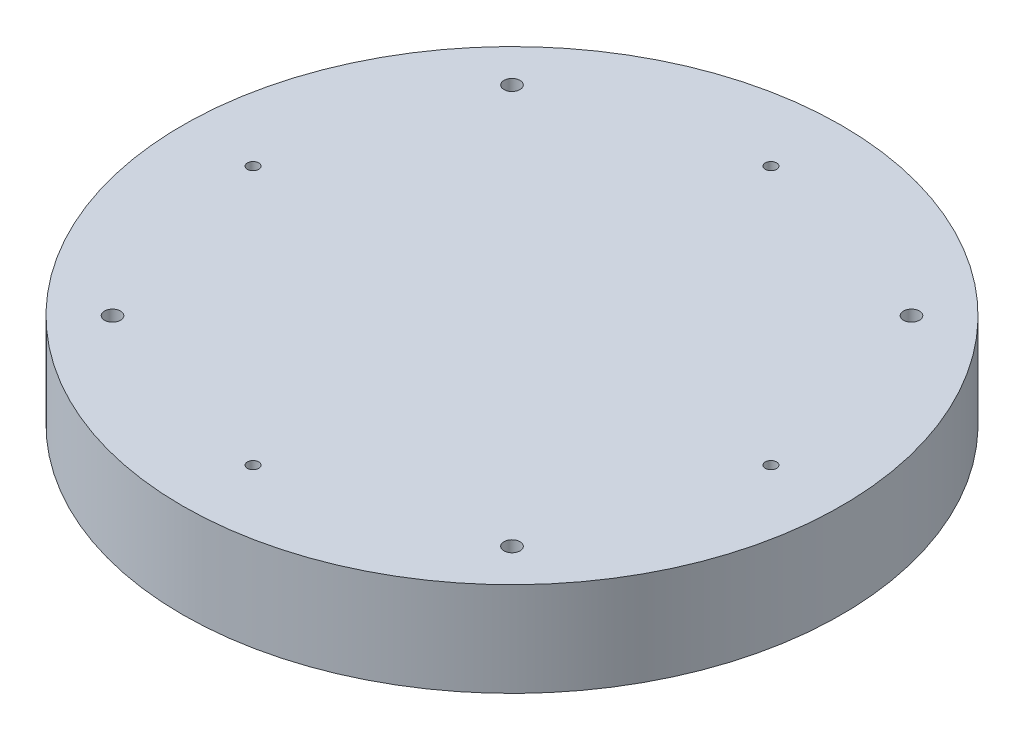
ISO-10303-21;
HEADER;
FILE_DESCRIPTION(('STEP AP214'),'2;1');
FILE_NAME('part.step','',(''),(''),'','','');
FILE_SCHEMA(('AUTOMOTIVE_DESIGN { 1 0 10303 214 1 1 1 1 }'));
ENDSEC;
DATA;
#1=APPLICATION_CONTEXT('core data for automotive mechanical design processes');
#2=APPLICATION_PROTOCOL_DEFINITION('international standard','automotive_design',2000,#1);
#3=PRODUCT_CONTEXT('',#1,'mechanical');
#4=PRODUCT('Part','Part','',(#3));
#5=PRODUCT_RELATED_PRODUCT_CATEGORY('part','',(#4));
#6=PRODUCT_DEFINITION_FORMATION('','',#4);
#7=PRODUCT_DEFINITION_CONTEXT('part definition',#1,'design');
#8=PRODUCT_DEFINITION('design','',#6,#7);
#9=PRODUCT_DEFINITION_SHAPE('','',#8);
#10=(LENGTH_UNIT() NAMED_UNIT(*) SI_UNIT(.MILLI.,.METRE.));
#11=(NAMED_UNIT(*) PLANE_ANGLE_UNIT() SI_UNIT($,.RADIAN.));
#12=(NAMED_UNIT(*) SI_UNIT($,.STERADIAN.) SOLID_ANGLE_UNIT());
#13=UNCERTAINTY_MEASURE_WITH_UNIT(LENGTH_MEASURE(1.E-05),#10,'distance_accuracy_value','');
#14=(GEOMETRIC_REPRESENTATION_CONTEXT(3) GLOBAL_UNCERTAINTY_ASSIGNED_CONTEXT((#13)) GLOBAL_UNIT_ASSIGNED_CONTEXT((#10,
#11,#12)) REPRESENTATION_CONTEXT('',''));
#15=CARTESIAN_POINT('',(0.,0.,0.));
#16=DIRECTION('',(0.,0.,1.));
#17=DIRECTION('',(1.,0.,0.));
#18=AXIS2_PLACEMENT_3D('',#15,#16,#17);
#19=CARTESIAN_POINT('',(0.,-20.,0.));
#20=DIRECTION('',(0.,-1.,0.));
#21=DIRECTION('',(0.,0.,-1.));
#22=AXIS2_PLACEMENT_3D('',#19,#20,#21);
#23=PLANE('',#22);
#24=CARTESIAN_POINT('',(-78.3673380921717,-20.,-0.00172774714470213));
#25=DIRECTION('',(0.,-1.,0.));
#26=DIRECTION('',(0.,0.,-1.));
#27=AXIS2_PLACEMENT_3D('',#24,#25,#26);
#28=CIRCLE('',#27,2.99999999999999);
#29=CARTESIAN_POINT('',(-78.3673380921717,-20.,-3.00172774714469));
#30=VERTEX_POINT('',#29);
#31=EDGE_CURVE('E78',#30,#30,#28,.T.);
#32=ORIENTED_EDGE('',*,*,#31,.F.);
#33=EDGE_LOOP('',(#32));
#34=FACE_BOUND('',#33,.T.);
#35=CARTESIAN_POINT('',(0.0678619078261153,-20.,78.4842722528575));
#36=DIRECTION('',(0.,-1.,0.));
#37=DIRECTION('',(0.,0.,-1.));
#38=AXIS2_PLACEMENT_3D('',#35,#36,#37);
#39=CIRCLE('',#38,2.99999999999999);
#40=CARTESIAN_POINT('',(0.0678619078261153,-20.,75.4842722528576));
#41=VERTEX_POINT('',#40);
#42=EDGE_CURVE('E77',#41,#41,#39,.T.);
#43=ORIENTED_EDGE('',*,*,#42,.F.);
#44=EDGE_LOOP('',(#43));
#45=FACE_BOUND('',#44,.T.);
#46=CARTESIAN_POINT('',(78.5030619078283,-20.,-0.00172774714025321));
#47=DIRECTION('',(0.,-1.,0.));
#48=DIRECTION('',(0.,0.,-1.));
#49=AXIS2_PLACEMENT_3D('',#46,#47,#48);
#50=CIRCLE('',#49,2.99999999999999);
#51=CARTESIAN_POINT('',(78.5030619078283,-20.,-3.00172774714024));
#52=VERTEX_POINT('',#51);
#53=EDGE_CURVE('E88',#52,#52,#50,.T.);
#54=ORIENTED_EDGE('',*,*,#53,.F.);
#55=EDGE_LOOP('',(#54));
#56=FACE_BOUND('',#55,.T.);
#57=CARTESIAN_POINT('',(0.0678619078261153,-20.,-78.4877277471425));
#58=DIRECTION('',(0.,-1.,0.));
#59=DIRECTION('',(0.,0.,-1.));
#60=AXIS2_PLACEMENT_3D('',#57,#58,#59);
#61=CIRCLE('',#60,2.99999999999999);
#62=CARTESIAN_POINT('',(0.0678619078261153,-20.,-81.4877277471425));
#63=VERTEX_POINT('',#62);
#64=EDGE_CURVE('E94',#63,#63,#61,.T.);
#65=ORIENTED_EDGE('',*,*,#64,.F.);
#66=EDGE_LOOP('',(#65));
#67=FACE_BOUND('',#66,.T.);
#68=CARTESIAN_POINT('',(-137.5,-20.,0.));
#69=DIRECTION('',(0.,1.,0.));
#70=DIRECTION('',(0.,0.,1.));
#71=AXIS2_PLACEMENT_3D('',#68,#69,#70);
#72=CIRCLE('',#71,2.99999999999998);
#73=CARTESIAN_POINT('',(-137.5,-20.,2.99999999999998));
#74=VERTEX_POINT('',#73);
#75=EDGE_CURVE('E103',#74,#74,#72,.T.);
#76=ORIENTED_EDGE('',*,*,#75,.T.);
#77=EDGE_LOOP('',(#76));
#78=FACE_BOUND('',#77,.T.);
#79=CARTESIAN_POINT('',(0.,-20.,137.5));
#80=DIRECTION('',(0.,1.,0.));
#81=DIRECTION('',(0.,0.,1.));
#82=AXIS2_PLACEMENT_3D('',#79,#80,#81);
#83=CIRCLE('',#82,2.99999999999999);
#84=CARTESIAN_POINT('',(0.,-20.,140.5));
#85=VERTEX_POINT('',#84);
#86=EDGE_CURVE('E109',#85,#85,#83,.T.);
#87=ORIENTED_EDGE('',*,*,#86,.T.);
#88=EDGE_LOOP('',(#87));
#89=FACE_BOUND('',#88,.T.);
#90=CARTESIAN_POINT('',(137.5,-20.,0.));
#91=DIRECTION('',(0.,1.,0.));
#92=DIRECTION('',(0.,0.,1.));
#93=AXIS2_PLACEMENT_3D('',#90,#91,#92);
#94=CIRCLE('',#93,2.99999999999998);
#95=CARTESIAN_POINT('',(137.5,-20.,2.99999999999998));
#96=VERTEX_POINT('',#95);
#97=EDGE_CURVE('E115',#96,#96,#94,.T.);
#98=ORIENTED_EDGE('',*,*,#97,.T.);
#99=EDGE_LOOP('',(#98));
#100=FACE_BOUND('',#99,.T.);
#101=CARTESIAN_POINT('',(0.,-20.,0.));
#102=DIRECTION('',(0.,-1.,0.));
#103=DIRECTION('',(0.,0.,-1.));
#104=AXIS2_PLACEMENT_3D('',#101,#102,#103);
#105=CIRCLE('',#104,175.);
#106=CARTESIAN_POINT('',(0.,-20.,-175.));
#107=VERTEX_POINT('',#106);
#108=EDGE_CURVE('E124',#107,#107,#105,.T.);
#109=ORIENTED_EDGE('',*,*,#108,.T.);
#110=EDGE_LOOP('',(#109));
#111=FACE_BOUND('',#110,.T.);
#112=CARTESIAN_POINT('',(0.,-20.,-137.5));
#113=DIRECTION('',(0.,1.,0.));
#114=DIRECTION('',(0.,0.,1.));
#115=AXIS2_PLACEMENT_3D('',#112,#113,#114);
#116=CIRCLE('',#115,2.99999999999999);
#117=CARTESIAN_POINT('',(0.,-20.,-134.5));
#118=VERTEX_POINT('',#117);
#119=EDGE_CURVE('E121',#118,#118,#116,.T.);
#120=ORIENTED_EDGE('',*,*,#119,.T.);
#121=EDGE_LOOP('',(#120));
#122=FACE_BOUND('',#121,.T.);
#123=ADVANCED_FACE('F34',(#34,#45,#56,#67,#78,#89,#100,#111,#122),#23,.T.);
#124=CARTESIAN_POINT('',(0.,30.,0.));
#125=DIRECTION('',(0.,-1.,0.));
#126=DIRECTION('',(0.,0.,-1.));
#127=AXIS2_PLACEMENT_3D('',#124,#125,#126);
#128=CYLINDRICAL_SURFACE('',#127,175.);
#129=CARTESIAN_POINT('',(0.,30.,0.));
#130=DIRECTION('',(0.,1.,0.));
#131=DIRECTION('',(0.,0.,1.));
#132=AXIS2_PLACEMENT_3D('',#129,#130,#131);
#133=CIRCLE('',#132,175.);
#134=CARTESIAN_POINT('',(0.,30.,175.));
#135=VERTEX_POINT('',#134);
#136=EDGE_CURVE('E11',#135,#135,#133,.T.);
#137=ORIENTED_EDGE('',*,*,#136,.F.);
#138=EDGE_LOOP('',(#137));
#139=FACE_BOUND('',#138,.T.);
#140=ORIENTED_EDGE('',*,*,#108,.F.);
#141=EDGE_LOOP('',(#140));
#142=FACE_BOUND('',#141,.T.);
#143=ADVANCED_FACE('F36',(#139,#142),#128,.T.);
#144=CARTESIAN_POINT('',(0.,30.,0.));
#145=DIRECTION('',(0.,1.,0.));
#146=DIRECTION('',(0.,0.,1.));
#147=AXIS2_PLACEMENT_3D('',#144,#145,#146);
#148=PLANE('',#147);
#149=CARTESIAN_POINT('',(-137.5,30.,0.));
#150=DIRECTION('',(0.,1.,0.));
#151=DIRECTION('',(0.,0.,1.));
#152=AXIS2_PLACEMENT_3D('',#149,#150,#151);
#153=CIRCLE('',#152,3.);
#154=CARTESIAN_POINT('',(-137.5,30.,3.));
#155=VERTEX_POINT('',#154);
#156=EDGE_CURVE('E100',#155,#155,#153,.T.);
#157=ORIENTED_EDGE('',*,*,#156,.F.);
#158=EDGE_LOOP('',(#157));
#159=FACE_BOUND('',#158,.T.);
#160=CARTESIAN_POINT('',(0.,30.,137.5));
#161=DIRECTION('',(0.,1.,0.));
#162=DIRECTION('',(0.,0.,1.));
#163=AXIS2_PLACEMENT_3D('',#160,#161,#162);
#164=CIRCLE('',#163,2.99999999999999);
#165=CARTESIAN_POINT('',(0.,30.,140.5));
#166=VERTEX_POINT('',#165);
#167=EDGE_CURVE('E106',#166,#166,#164,.T.);
#168=ORIENTED_EDGE('',*,*,#167,.F.);
#169=EDGE_LOOP('',(#168));
#170=FACE_BOUND('',#169,.T.);
#171=CARTESIAN_POINT('',(137.5,30.,0.));
#172=DIRECTION('',(0.,1.,0.));
#173=DIRECTION('',(0.,0.,1.));
#174=AXIS2_PLACEMENT_3D('',#171,#172,#173);
#175=CIRCLE('',#174,3.);
#176=CARTESIAN_POINT('',(137.5,30.,3.));
#177=VERTEX_POINT('',#176);
#178=EDGE_CURVE('E112',#177,#177,#175,.T.);
#179=ORIENTED_EDGE('',*,*,#178,.F.);
#180=EDGE_LOOP('',(#179));
#181=FACE_BOUND('',#180,.T.);
#182=CARTESIAN_POINT('',(0.,30.,-137.5));
#183=DIRECTION('',(0.,1.,0.));
#184=DIRECTION('',(0.,0.,1.));
#185=AXIS2_PLACEMENT_3D('',#182,#183,#184);
#186=CIRCLE('',#185,2.99999999999999);
#187=CARTESIAN_POINT('',(0.,30.,-134.5));
#188=VERTEX_POINT('',#187);
#189=EDGE_CURVE('E118',#188,#188,#186,.T.);
#190=ORIENTED_EDGE('',*,*,#189,.F.);
#191=EDGE_LOOP('',(#190));
#192=FACE_BOUND('',#191,.T.);
#193=CARTESIAN_POINT('',(-106.066017177982,30.,106.066017177982));
#194=DIRECTION('',(0.,1.,0.));
#195=DIRECTION('',(0.,0.,1.));
#196=AXIS2_PLACEMENT_3D('',#193,#194,#195);
#197=CIRCLE('',#196,4.25);
#198=CARTESIAN_POINT('',(-106.066017177982,30.,110.316017177982));
#199=VERTEX_POINT('',#198);
#200=EDGE_CURVE('E127',#199,#199,#197,.T.);
#201=ORIENTED_EDGE('',*,*,#200,.F.);
#202=EDGE_LOOP('',(#201));
#203=FACE_BOUND('',#202,.T.);
#204=CARTESIAN_POINT('',(106.066017177982,30.,106.066017177982));
#205=DIRECTION('',(0.,1.,0.));
#206=DIRECTION('',(0.,0.,1.));
#207=AXIS2_PLACEMENT_3D('',#204,#205,#206);
#208=CIRCLE('',#207,4.25);
#209=CARTESIAN_POINT('',(106.066017177982,30.,110.316017177982));
#210=VERTEX_POINT('',#209);
#211=EDGE_CURVE('E133',#210,#210,#208,.T.);
#212=ORIENTED_EDGE('',*,*,#211,.F.);
#213=EDGE_LOOP('',(#212));
#214=FACE_BOUND('',#213,.T.);
#215=CARTESIAN_POINT('',(106.066017177982,30.,-106.066017177982));
#216=DIRECTION('',(0.,1.,0.));
#217=DIRECTION('',(0.,0.,1.));
#218=AXIS2_PLACEMENT_3D('',#215,#216,#217);
#219=CIRCLE('',#218,4.25);
#220=CARTESIAN_POINT('',(106.066017177982,30.,-101.816017177982));
#221=VERTEX_POINT('',#220);
#222=EDGE_CURVE('E139',#221,#221,#219,.T.);
#223=ORIENTED_EDGE('',*,*,#222,.F.);
#224=EDGE_LOOP('',(#223));
#225=FACE_BOUND('',#224,.T.);
#226=CARTESIAN_POINT('',(-106.066017177982,30.,-106.066017177982));
#227=DIRECTION('',(0.,1.,0.));
#228=DIRECTION('',(0.,0.,1.));
#229=AXIS2_PLACEMENT_3D('',#226,#227,#228);
#230=CIRCLE('',#229,4.25);
#231=CARTESIAN_POINT('',(-106.066017177982,30.,-101.816017177982));
#232=VERTEX_POINT('',#231);
#233=EDGE_CURVE('E145',#232,#232,#230,.T.);
#234=ORIENTED_EDGE('',*,*,#233,.F.);
#235=EDGE_LOOP('',(#234));
#236=FACE_BOUND('',#235,.T.);
#237=ORIENTED_EDGE('',*,*,#136,.T.);
#238=EDGE_LOOP('',(#237));
#239=FACE_BOUND('',#238,.T.);
#240=ADVANCED_FACE('F159',(#159,#170,#181,#192,#203,#214,#225,#236,#239),#148,.T.);
#241=CARTESIAN_POINT('',(-106.066017177982,10.,-106.066017177982));
#242=DIRECTION('',(0.,1.,0.));
#243=DIRECTION('',(0.,0.,1.));
#244=AXIS2_PLACEMENT_3D('',#241,#242,#243);
#245=CONICAL_SURFACE('',#244,4.24999999999999,1.02974425867665);
#246=CARTESIAN_POINT('',(-106.066017177982,7.44634236913287,-106.066017177982));
#247=VERTEX_POINT('',#246);
#248=VERTEX_LOOP('',#247);
#249=FACE_BOUND('',#248,.T.);
#250=CARTESIAN_POINT('',(-106.066017177982,10.,-106.066017177982));
#251=DIRECTION('',(0.,1.,0.));
#252=DIRECTION('',(0.,0.,1.));
#253=AXIS2_PLACEMENT_3D('',#250,#251,#252);
#254=CIRCLE('',#253,4.24999999999999);
#255=CARTESIAN_POINT('',(-106.066017177982,10.,-101.816017177982));
#256=VERTEX_POINT('',#255);
#257=EDGE_CURVE('E42',#256,#256,#254,.T.);
#258=ORIENTED_EDGE('',*,*,#257,.T.);
#259=EDGE_LOOP('',(#258));
#260=FACE_BOUND('',#259,.T.);
#261=ADVANCED_FACE('F150',(#249,#260),#245,.F.);
#262=CARTESIAN_POINT('',(-106.066017177982,30.,-106.066017177982));
#263=DIRECTION('',(0.,1.,0.));
#264=DIRECTION('',(0.,0.,1.));
#265=AXIS2_PLACEMENT_3D('',#262,#263,#264);
#266=CYLINDRICAL_SURFACE('',#265,4.25);
#267=ORIENTED_EDGE('',*,*,#257,.F.);
#268=EDGE_LOOP('',(#267));
#269=FACE_BOUND('',#268,.T.);
#270=ORIENTED_EDGE('',*,*,#233,.T.);
#271=EDGE_LOOP('',(#270));
#272=FACE_BOUND('',#271,.T.);
#273=ADVANCED_FACE('F152',(#269,#272),#266,.F.);
#274=CARTESIAN_POINT('',(106.066017177982,10.,-106.066017177982));
#275=DIRECTION('',(0.,1.,0.));
#276=DIRECTION('',(0.,0.,1.));
#277=AXIS2_PLACEMENT_3D('',#274,#275,#276);
#278=CONICAL_SURFACE('',#277,4.25,1.02974425867665);
#279=CARTESIAN_POINT('',(106.066017177982,7.44634236913287,-106.066017177982));
#280=VERTEX_POINT('',#279);
#281=VERTEX_LOOP('',#280);
#282=FACE_BOUND('',#281,.T.);
#283=CARTESIAN_POINT('',(106.066017177982,10.,-106.066017177982));
#284=DIRECTION('',(0.,1.,0.));
#285=DIRECTION('',(0.,0.,1.));
#286=AXIS2_PLACEMENT_3D('',#283,#284,#285);
#287=CIRCLE('',#286,4.25);
#288=CARTESIAN_POINT('',(106.066017177982,10.,-101.816017177982));
#289=VERTEX_POINT('',#288);
#290=EDGE_CURVE('E142',#289,#289,#287,.T.);
#291=ORIENTED_EDGE('',*,*,#290,.T.);
#292=EDGE_LOOP('',(#291));
#293=FACE_BOUND('',#292,.T.);
#294=ADVANCED_FACE('F155',(#282,#293),#278,.F.);
#295=CARTESIAN_POINT('',(106.066017177982,30.,-106.066017177982));
#296=DIRECTION('',(0.,1.,0.));
#297=DIRECTION('',(0.,0.,1.));
#298=AXIS2_PLACEMENT_3D('',#295,#296,#297);
#299=CYLINDRICAL_SURFACE('',#298,4.25);
#300=ORIENTED_EDGE('',*,*,#290,.F.);
#301=EDGE_LOOP('',(#300));
#302=FACE_BOUND('',#301,.T.);
#303=ORIENTED_EDGE('',*,*,#222,.T.);
#304=EDGE_LOOP('',(#303));
#305=FACE_BOUND('',#304,.T.);
#306=ADVANCED_FACE('F190',(#302,#305),#299,.F.);
#307=CARTESIAN_POINT('',(106.066017177982,10.,106.066017177982));
#308=DIRECTION('',(0.,1.,0.));
#309=DIRECTION('',(0.,0.,1.));
#310=AXIS2_PLACEMENT_3D('',#307,#308,#309);
#311=CONICAL_SURFACE('',#310,4.25,1.02974425867665);
#312=CARTESIAN_POINT('',(106.066017177982,7.44634236913287,106.066017177982));
#313=VERTEX_POINT('',#312);
#314=VERTEX_LOOP('',#313);
#315=FACE_BOUND('',#314,.T.);
#316=CARTESIAN_POINT('',(106.066017177982,10.,106.066017177982));
#317=DIRECTION('',(0.,1.,0.));
#318=DIRECTION('',(0.,0.,1.));
#319=AXIS2_PLACEMENT_3D('',#316,#317,#318);
#320=CIRCLE('',#319,4.25);
#321=CARTESIAN_POINT('',(106.066017177982,10.,110.316017177982));
#322=VERTEX_POINT('',#321);
#323=EDGE_CURVE('E136',#322,#322,#320,.T.);
#324=ORIENTED_EDGE('',*,*,#323,.T.);
#325=EDGE_LOOP('',(#324));
#326=FACE_BOUND('',#325,.T.);
#327=ADVANCED_FACE('F192',(#315,#326),#311,.F.);
#328=CARTESIAN_POINT('',(106.066017177982,30.,106.066017177982));
#329=DIRECTION('',(0.,1.,0.));
#330=DIRECTION('',(0.,0.,1.));
#331=AXIS2_PLACEMENT_3D('',#328,#329,#330);
#332=CYLINDRICAL_SURFACE('',#331,4.25);
#333=ORIENTED_EDGE('',*,*,#323,.F.);
#334=EDGE_LOOP('',(#333));
#335=FACE_BOUND('',#334,.T.);
#336=ORIENTED_EDGE('',*,*,#211,.T.);
#337=EDGE_LOOP('',(#336));
#338=FACE_BOUND('',#337,.T.);
#339=ADVANCED_FACE('F199',(#335,#338),#332,.F.);
#340=CARTESIAN_POINT('',(-106.066017177982,10.,106.066017177982));
#341=DIRECTION('',(0.,1.,0.));
#342=DIRECTION('',(0.,0.,1.));
#343=AXIS2_PLACEMENT_3D('',#340,#341,#342);
#344=CONICAL_SURFACE('',#343,4.24999999999999,1.02974425867665);
#345=CARTESIAN_POINT('',(-106.066017177982,7.44634236913287,106.066017177982));
#346=VERTEX_POINT('',#345);
#347=VERTEX_LOOP('',#346);
#348=FACE_BOUND('',#347,.T.);
#349=CARTESIAN_POINT('',(-106.066017177982,10.,106.066017177982));
#350=DIRECTION('',(0.,1.,0.));
#351=DIRECTION('',(0.,0.,1.));
#352=AXIS2_PLACEMENT_3D('',#349,#350,#351);
#353=CIRCLE('',#352,4.24999999999999);
#354=CARTESIAN_POINT('',(-106.066017177982,10.,110.316017177982));
#355=VERTEX_POINT('',#354);
#356=EDGE_CURVE('E130',#355,#355,#353,.T.);
#357=ORIENTED_EDGE('',*,*,#356,.T.);
#358=EDGE_LOOP('',(#357));
#359=FACE_BOUND('',#358,.T.);
#360=ADVANCED_FACE('F244',(#348,#359),#344,.F.);
#361=CARTESIAN_POINT('',(-106.066017177982,30.,106.066017177982));
#362=DIRECTION('',(0.,1.,0.));
#363=DIRECTION('',(0.,0.,1.));
#364=AXIS2_PLACEMENT_3D('',#361,#362,#363);
#365=CYLINDRICAL_SURFACE('',#364,4.25);
#366=ORIENTED_EDGE('',*,*,#356,.F.);
#367=EDGE_LOOP('',(#366));
#368=FACE_BOUND('',#367,.T.);
#369=ORIENTED_EDGE('',*,*,#200,.T.);
#370=EDGE_LOOP('',(#369));
#371=FACE_BOUND('',#370,.T.);
#372=ADVANCED_FACE('F179',(#368,#371),#365,.F.);
#373=CARTESIAN_POINT('',(0.,30.,-137.5));
#374=DIRECTION('',(0.,1.,0.));
#375=DIRECTION('',(0.,0.,1.));
#376=AXIS2_PLACEMENT_3D('',#373,#374,#375);
#377=CYLINDRICAL_SURFACE('',#376,2.99999999999999);
#378=ORIENTED_EDGE('',*,*,#119,.F.);
#379=EDGE_LOOP('',(#378));
#380=FACE_BOUND('',#379,.T.);
#381=ORIENTED_EDGE('',*,*,#189,.T.);
#382=EDGE_LOOP('',(#381));
#383=FACE_BOUND('',#382,.T.);
#384=ADVANCED_FACE('F175',(#380,#383),#377,.F.);
#385=CARTESIAN_POINT('',(137.5,30.,0.));
#386=DIRECTION('',(0.,1.,0.));
#387=DIRECTION('',(0.,0.,1.));
#388=AXIS2_PLACEMENT_3D('',#385,#386,#387);
#389=CYLINDRICAL_SURFACE('',#388,2.99999999999999);
#390=ORIENTED_EDGE('',*,*,#97,.F.);
#391=EDGE_LOOP('',(#390));
#392=FACE_BOUND('',#391,.T.);
#393=ORIENTED_EDGE('',*,*,#178,.T.);
#394=EDGE_LOOP('',(#393));
#395=FACE_BOUND('',#394,.T.);
#396=ADVANCED_FACE('F178',(#392,#395),#389,.F.);
#397=CARTESIAN_POINT('',(0.,30.,137.5));
#398=DIRECTION('',(0.,1.,0.));
#399=DIRECTION('',(0.,0.,1.));
#400=AXIS2_PLACEMENT_3D('',#397,#398,#399);
#401=CYLINDRICAL_SURFACE('',#400,2.99999999999999);
#402=ORIENTED_EDGE('',*,*,#86,.F.);
#403=EDGE_LOOP('',(#402));
#404=FACE_BOUND('',#403,.T.);
#405=ORIENTED_EDGE('',*,*,#167,.T.);
#406=EDGE_LOOP('',(#405));
#407=FACE_BOUND('',#406,.T.);
#408=ADVANCED_FACE('F289',(#404,#407),#401,.F.);
#409=CARTESIAN_POINT('',(-137.5,30.,0.));
#410=DIRECTION('',(0.,1.,0.));
#411=DIRECTION('',(0.,0.,1.));
#412=AXIS2_PLACEMENT_3D('',#409,#410,#411);
#413=CYLINDRICAL_SURFACE('',#412,2.99999999999999);
#414=ORIENTED_EDGE('',*,*,#75,.F.);
#415=EDGE_LOOP('',(#414));
#416=FACE_BOUND('',#415,.T.);
#417=ORIENTED_EDGE('',*,*,#156,.T.);
#418=EDGE_LOOP('',(#417));
#419=FACE_BOUND('',#418,.T.);
#420=ADVANCED_FACE('F299',(#416,#419),#413,.F.);
#421=CARTESIAN_POINT('',(0.0678619078261153,0.,-78.4877277471425));
#422=DIRECTION('',(0.,-1.,0.));
#423=DIRECTION('',(0.,0.,-1.));
#424=AXIS2_PLACEMENT_3D('',#421,#422,#423);
#425=CONICAL_SURFACE('',#424,2.99999999999999,1.02974425867665);
#426=CARTESIAN_POINT('',(0.0678619078261099,1.80258185708268,-78.4877277471425));
#427=VERTEX_POINT('',#426);
#428=VERTEX_LOOP('',#427);
#429=FACE_BOUND('',#428,.T.);
#430=CARTESIAN_POINT('',(0.0678619078261153,0.,-78.4877277471425));
#431=DIRECTION('',(0.,-1.,0.));
#432=DIRECTION('',(0.,0.,-1.));
#433=AXIS2_PLACEMENT_3D('',#430,#431,#432);
#434=CIRCLE('',#433,2.99999999999999);
#435=CARTESIAN_POINT('',(0.0678619078261153,0.,-81.4877277471425));
#436=VERTEX_POINT('',#435);
#437=EDGE_CURVE('E97',#436,#436,#434,.T.);
#438=ORIENTED_EDGE('',*,*,#437,.T.);
#439=EDGE_LOOP('',(#438));
#440=FACE_BOUND('',#439,.T.);
#441=ADVANCED_FACE('F309',(#429,#440),#425,.F.);
#442=CARTESIAN_POINT('',(0.0678619078261153,-20.,-78.4877277471425));
#443=DIRECTION('',(0.,-1.,0.));
#444=DIRECTION('',(0.,0.,-1.));
#445=AXIS2_PLACEMENT_3D('',#442,#443,#444);
#446=CYLINDRICAL_SURFACE('',#445,2.99999999999999);
#447=ORIENTED_EDGE('',*,*,#437,.F.);
#448=EDGE_LOOP('',(#447));
#449=FACE_BOUND('',#448,.T.);
#450=ORIENTED_EDGE('',*,*,#64,.T.);
#451=EDGE_LOOP('',(#450));
#452=FACE_BOUND('',#451,.T.);
#453=ADVANCED_FACE('F324',(#449,#452),#446,.F.);
#454=CARTESIAN_POINT('',(78.5030619078283,0.,-0.00172774714025321));
#455=DIRECTION('',(0.,-1.,0.));
#456=DIRECTION('',(0.,0.,-1.));
#457=AXIS2_PLACEMENT_3D('',#454,#455,#456);
#458=CONICAL_SURFACE('',#457,2.99999999999999,1.02974425867665);
#459=CARTESIAN_POINT('',(78.5030619078283,1.80258185708268,-0.00172774714025321));
#460=VERTEX_POINT('',#459);
#461=VERTEX_LOOP('',#460);
#462=FACE_BOUND('',#461,.T.);
#463=CARTESIAN_POINT('',(78.5030619078283,0.,-0.00172774714025321));
#464=DIRECTION('',(0.,-1.,0.));
#465=DIRECTION('',(0.,0.,-1.));
#466=AXIS2_PLACEMENT_3D('',#463,#464,#465);
#467=CIRCLE('',#466,2.99999999999999);
#468=CARTESIAN_POINT('',(78.5030619078283,0.,-3.00172774714024));
#469=VERTEX_POINT('',#468);
#470=EDGE_CURVE('E91',#469,#469,#467,.T.);
#471=ORIENTED_EDGE('',*,*,#470,.T.);
#472=EDGE_LOOP('',(#471));
#473=FACE_BOUND('',#472,.T.);
#474=ADVANCED_FACE('F334',(#462,#473),#458,.F.);
#475=CARTESIAN_POINT('',(78.5030619078283,-20.,-0.00172774714025321));
#476=DIRECTION('',(0.,-1.,0.));
#477=DIRECTION('',(0.,0.,-1.));
#478=AXIS2_PLACEMENT_3D('',#475,#476,#477);
#479=CYLINDRICAL_SURFACE('',#478,2.99999999999999);
#480=ORIENTED_EDGE('',*,*,#470,.F.);
#481=EDGE_LOOP('',(#480));
#482=FACE_BOUND('',#481,.T.);
#483=ORIENTED_EDGE('',*,*,#53,.T.);
#484=EDGE_LOOP('',(#483));
#485=FACE_BOUND('',#484,.T.);
#486=ADVANCED_FACE('F344',(#482,#485),#479,.F.);
#487=CARTESIAN_POINT('',(0.0678619078261153,0.,78.4842722528575));
#488=DIRECTION('',(0.,-1.,0.));
#489=DIRECTION('',(0.,0.,-1.));
#490=AXIS2_PLACEMENT_3D('',#487,#488,#489);
#491=CONICAL_SURFACE('',#490,2.99999999999999,1.02974425867665);
#492=CARTESIAN_POINT('',(0.0678619078261099,1.80258185708268,78.4842722528575));
#493=VERTEX_POINT('',#492);
#494=VERTEX_LOOP('',#493);
#495=FACE_BOUND('',#494,.T.);
#496=CARTESIAN_POINT('',(0.0678619078261153,0.,78.4842722528575));
#497=DIRECTION('',(0.,-1.,0.));
#498=DIRECTION('',(0.,0.,-1.));
#499=AXIS2_PLACEMENT_3D('',#496,#497,#498);
#500=CIRCLE('',#499,2.99999999999999);
#501=CARTESIAN_POINT('',(0.0678619078261153,0.,75.4842722528576));
#502=VERTEX_POINT('',#501);
#503=EDGE_CURVE('E81',#502,#502,#500,.T.);
#504=ORIENTED_EDGE('',*,*,#503,.T.);
#505=EDGE_LOOP('',(#504));
#506=FACE_BOUND('',#505,.T.);
#507=ADVANCED_FACE('F354',(#495,#506),#491,.F.);
#508=CARTESIAN_POINT('',(0.0678619078261153,-20.,78.4842722528575));
#509=DIRECTION('',(0.,-1.,0.));
#510=DIRECTION('',(0.,0.,-1.));
#511=AXIS2_PLACEMENT_3D('',#508,#509,#510);
#512=CYLINDRICAL_SURFACE('',#511,2.99999999999999);
#513=ORIENTED_EDGE('',*,*,#503,.F.);
#514=EDGE_LOOP('',(#513));
#515=FACE_BOUND('',#514,.T.);
#516=ORIENTED_EDGE('',*,*,#42,.T.);
#517=EDGE_LOOP('',(#516));
#518=FACE_BOUND('',#517,.T.);
#519=ADVANCED_FACE('F71',(#515,#518),#512,.F.);
#520=CARTESIAN_POINT('',(-78.3673380921717,0.,-0.00172774714470213));
#521=DIRECTION('',(0.,-1.,0.));
#522=DIRECTION('',(0.,0.,-1.));
#523=AXIS2_PLACEMENT_3D('',#520,#521,#522);
#524=CONICAL_SURFACE('',#523,2.99999999999999,1.02974425867665);
#525=CARTESIAN_POINT('',(-78.3673380921717,1.80258185708268,-0.00172774714470213));
#526=VERTEX_POINT('',#525);
#527=VERTEX_LOOP('',#526);
#528=FACE_BOUND('',#527,.T.);
#529=CARTESIAN_POINT('',(-78.3673380921717,0.,-0.00172774714470213));
#530=DIRECTION('',(0.,-1.,0.));
#531=DIRECTION('',(0.,0.,-1.));
#532=AXIS2_PLACEMENT_3D('',#529,#530,#531);
#533=CIRCLE('',#532,2.99999999999999);
#534=CARTESIAN_POINT('',(-78.3673380921717,0.,-3.00172774714469));
#535=VERTEX_POINT('',#534);
#536=EDGE_CURVE('E75',#535,#535,#533,.T.);
#537=ORIENTED_EDGE('',*,*,#536,.T.);
#538=EDGE_LOOP('',(#537));
#539=FACE_BOUND('',#538,.T.);
#540=ADVANCED_FACE('F67',(#528,#539),#524,.F.);
#541=CARTESIAN_POINT('',(-78.3673380921717,-20.,-0.00172774714470213));
#542=DIRECTION('',(0.,-1.,0.));
#543=DIRECTION('',(0.,0.,-1.));
#544=AXIS2_PLACEMENT_3D('',#541,#542,#543);
#545=CYLINDRICAL_SURFACE('',#544,2.99999999999999);
#546=ORIENTED_EDGE('',*,*,#536,.F.);
#547=EDGE_LOOP('',(#546));
#548=FACE_BOUND('',#547,.T.);
#549=ORIENTED_EDGE('',*,*,#31,.T.);
#550=EDGE_LOOP('',(#549));
#551=FACE_BOUND('',#550,.T.);
#552=ADVANCED_FACE('F70',(#548,#551),#545,.F.);
#553=CLOSED_SHELL('',(#123,#143,#240,#261,#273,#294,#306,#327,#339,#360,#372,#384,#396,#408,
#420,#441,#453,#474,#486,#507,#519,#540,#552));
#554=MANIFOLD_SOLID_BREP('B2',#553);
#555=ADVANCED_BREP_SHAPE_REPRESENTATION('',(#18,#554),#14);
#556=SHAPE_DEFINITION_REPRESENTATION(#9,#555);
ENDSEC;
END-ISO-10303-21;
